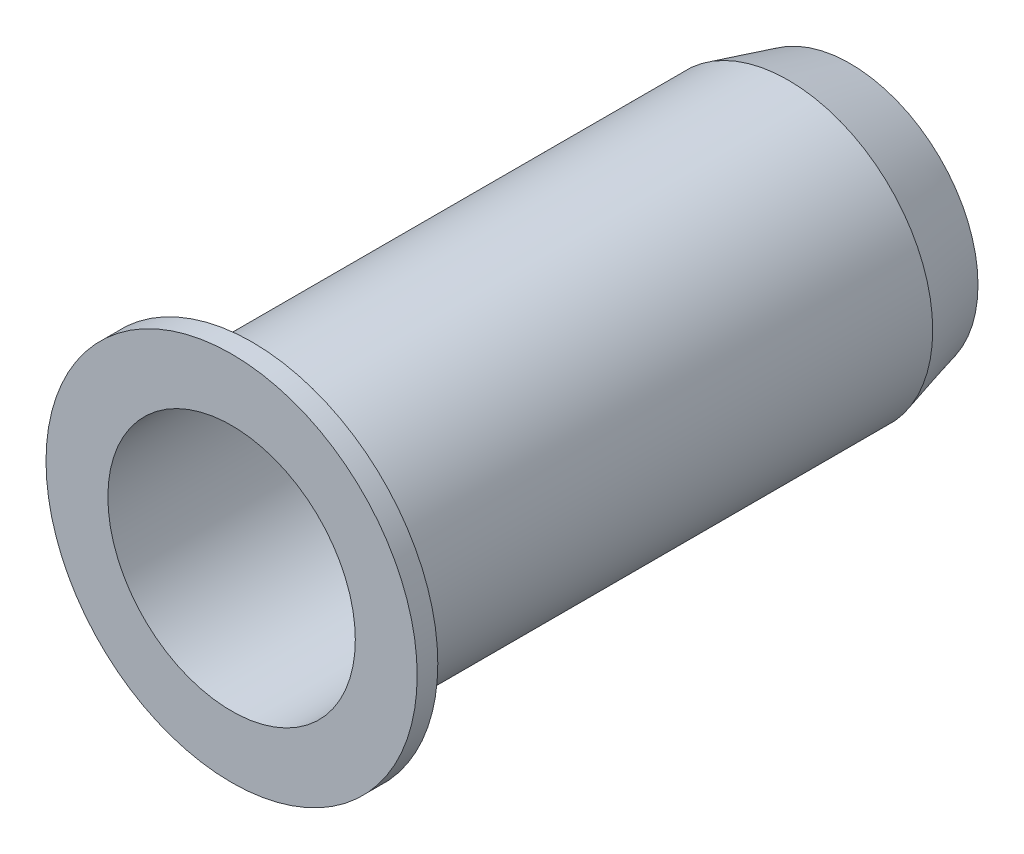
ISO-10303-21;
HEADER;
FILE_DESCRIPTION(('STEP AP214'),'2;1');
FILE_NAME('part.step','',(''),(''),'','','');
FILE_SCHEMA(('AUTOMOTIVE_DESIGN { 1 0 10303 214 1 1 1 1 }'));
ENDSEC;
DATA;
#1=APPLICATION_CONTEXT('core data for automotive mechanical design processes');
#2=APPLICATION_PROTOCOL_DEFINITION('international standard','automotive_design',2000,#1);
#3=PRODUCT_CONTEXT('',#1,'mechanical');
#4=PRODUCT('Part','Part','',(#3));
#5=PRODUCT_RELATED_PRODUCT_CATEGORY('part','',(#4));
#6=PRODUCT_DEFINITION_FORMATION('','',#4);
#7=PRODUCT_DEFINITION_CONTEXT('part definition',#1,'design');
#8=PRODUCT_DEFINITION('design','',#6,#7);
#9=PRODUCT_DEFINITION_SHAPE('','',#8);
#10=(LENGTH_UNIT() NAMED_UNIT(*) SI_UNIT(.MILLI.,.METRE.));
#11=(NAMED_UNIT(*) PLANE_ANGLE_UNIT() SI_UNIT($,.RADIAN.));
#12=(NAMED_UNIT(*) SI_UNIT($,.STERADIAN.) SOLID_ANGLE_UNIT());
#13=UNCERTAINTY_MEASURE_WITH_UNIT(LENGTH_MEASURE(1.E-05),#10,'distance_accuracy_value','');
#14=(GEOMETRIC_REPRESENTATION_CONTEXT(3) GLOBAL_UNCERTAINTY_ASSIGNED_CONTEXT((#13)) GLOBAL_UNIT_ASSIGNED_CONTEXT((#10,
#11,#12)) REPRESENTATION_CONTEXT('',''));
#15=CARTESIAN_POINT('',(0.,0.,0.));
#16=DIRECTION('',(0.,0.,1.));
#17=DIRECTION('',(1.,0.,0.));
#18=AXIS2_PLACEMENT_3D('',#15,#16,#17);
#19=CARTESIAN_POINT('',(0.,0.,0.));
#20=DIRECTION('',(0.,0.,1.));
#21=DIRECTION('',(1.,0.,0.));
#22=AXIS2_PLACEMENT_3D('',#19,#20,#21);
#23=PLANE('',#22);
#24=CARTESIAN_POINT('',(0.,0.,0.));
#25=DIRECTION('',(0.,0.,1.));
#26=DIRECTION('',(1.,0.,0.));
#27=AXIS2_PLACEMENT_3D('',#24,#25,#26);
#28=CIRCLE('',#27,3.0980762113533);
#29=CARTESIAN_POINT('',(3.0980762113533,0.,0.));
#30=VERTEX_POINT('',#29);
#31=EDGE_CURVE('E10',#30,#30,#28,.F.);
#32=ORIENTED_EDGE('',*,*,#31,.T.);
#33=EDGE_LOOP('',(#32));
#34=FACE_BOUND('',#33,.T.);
#35=CARTESIAN_POINT('',(0.,0.,0.));
#36=DIRECTION('',(0.,0.,1.));
#37=DIRECTION('',(1.,0.,0.));
#38=AXIS2_PLACEMENT_3D('',#35,#36,#37);
#39=CIRCLE('',#38,3.);
#40=CARTESIAN_POINT('',(-3.,0.,0.));
#41=VERTEX_POINT('',#40);
#42=EDGE_CURVE('E46',#41,#41,#39,.T.);
#43=ORIENTED_EDGE('',*,*,#42,.T.);
#44=EDGE_LOOP('',(#43));
#45=FACE_BOUND('',#44,.T.);
#46=ADVANCED_FACE('F31',(#34,#45),#23,.F.);
#47=CARTESIAN_POINT('',(0.,0.,14.5));
#48=DIRECTION('',(0.,0.,-1.));
#49=DIRECTION('',(-1.,0.,0.));
#50=AXIS2_PLACEMENT_3D('',#47,#48,#49);
#51=CYLINDRICAL_SURFACE('',#50,3.5);
#52=CARTESIAN_POINT('',(0.,0.,1.5));
#53=DIRECTION('',(0.,0.,1.));
#54=DIRECTION('',(1.,0.,0.));
#55=AXIS2_PLACEMENT_3D('',#52,#53,#54);
#56=CIRCLE('',#55,3.5);
#57=CARTESIAN_POINT('',(-3.5,0.,1.5));
#58=VERTEX_POINT('',#57);
#59=EDGE_CURVE('E38',#58,#58,#56,.T.);
#60=CARTESIAN_POINT('',(0.,0.,14.5));
#61=DIRECTION('',(0.,0.,1.));
#62=DIRECTION('',(1.,0.,0.));
#63=AXIS2_PLACEMENT_3D('',#60,#61,#62);
#64=CIRCLE('',#63,3.5);
#65=CARTESIAN_POINT('',(-3.5,0.,14.5));
#66=VERTEX_POINT('',#65);
#67=EDGE_CURVE('E42',#66,#66,#64,.T.);
#68=CARTESIAN_POINT('',(-3.5,0.,1.5));
#69=CARTESIAN_POINT('',(-3.5,0.,1.63541666666667));
#70=CARTESIAN_POINT('',(-3.5,0.,1.77083333333334));
#71=CARTESIAN_POINT('',(-3.5,0.,2.04166666666667));
#72=CARTESIAN_POINT('',(-3.5,0.,2.17708333333334));
#73=CARTESIAN_POINT('',(-3.5,0.,2.44791666666667));
#74=CARTESIAN_POINT('',(-3.5,0.,2.58333333333333));
#75=CARTESIAN_POINT('',(-3.5,0.,2.85416666666667));
#76=CARTESIAN_POINT('',(-3.5,0.,2.98958333333333));
#77=CARTESIAN_POINT('',(-3.5,0.,3.26041666666667));
#78=CARTESIAN_POINT('',(-3.5,0.,3.39583333333333));
#79=CARTESIAN_POINT('',(-3.5,0.,3.66666666666667));
#80=CARTESIAN_POINT('',(-3.5,0.,3.80208333333333));
#81=CARTESIAN_POINT('',(-3.5,0.,4.07291666666667));
#82=CARTESIAN_POINT('',(-3.5,0.,4.20833333333333));
#83=CARTESIAN_POINT('',(-3.5,0.,4.47916666666667));
#84=CARTESIAN_POINT('',(-3.5,0.,4.61458333333333));
#85=CARTESIAN_POINT('',(-3.5,0.,4.88541666666667));
#86=CARTESIAN_POINT('',(-3.5,0.,5.02083333333333));
#87=CARTESIAN_POINT('',(-3.5,0.,5.29166666666667));
#88=CARTESIAN_POINT('',(-3.5,0.,5.42708333333333));
#89=CARTESIAN_POINT('',(-3.5,0.,5.69791666666667));
#90=CARTESIAN_POINT('',(-3.5,0.,5.83333333333334));
#91=CARTESIAN_POINT('',(-3.5,0.,6.10416666666667));
#92=CARTESIAN_POINT('',(-3.5,0.,6.23958333333334));
#93=CARTESIAN_POINT('',(-3.5,0.,6.51041666666667));
#94=CARTESIAN_POINT('',(-3.5,0.,6.64583333333333));
#95=CARTESIAN_POINT('',(-3.5,0.,6.91666666666667));
#96=CARTESIAN_POINT('',(-3.5,0.,7.05208333333333));
#97=CARTESIAN_POINT('',(-3.5,0.,7.32291666666667));
#98=CARTESIAN_POINT('',(-3.5,0.,7.45833333333333));
#99=CARTESIAN_POINT('',(-3.5,0.,7.72916666666667));
#100=CARTESIAN_POINT('',(-3.5,0.,7.86458333333333));
#101=CARTESIAN_POINT('',(-3.5,0.,8.13541666666667));
#102=CARTESIAN_POINT('',(-3.5,0.,8.27083333333333));
#103=CARTESIAN_POINT('',(-3.5,0.,8.54166666666667));
#104=CARTESIAN_POINT('',(-3.5,0.,8.67708333333333));
#105=CARTESIAN_POINT('',(-3.5,0.,8.94791666666667));
#106=CARTESIAN_POINT('',(-3.5,0.,9.08333333333333));
#107=CARTESIAN_POINT('',(-3.5,0.,9.35416666666667));
#108=CARTESIAN_POINT('',(-3.5,0.,9.48958333333333));
#109=CARTESIAN_POINT('',(-3.5,0.,9.76041666666667));
#110=CARTESIAN_POINT('',(-3.5,0.,9.89583333333333));
#111=CARTESIAN_POINT('',(-3.5,0.,10.1666666666667));
#112=CARTESIAN_POINT('',(-3.5,0.,10.3020833333333));
#113=CARTESIAN_POINT('',(-3.5,0.,10.5729166666667));
#114=CARTESIAN_POINT('',(-3.5,0.,10.7083333333333));
#115=CARTESIAN_POINT('',(-3.5,0.,10.9791666666667));
#116=CARTESIAN_POINT('',(-3.5,0.,11.1145833333333));
#117=CARTESIAN_POINT('',(-3.5,0.,11.3854166666667));
#118=CARTESIAN_POINT('',(-3.5,0.,11.5208333333333));
#119=CARTESIAN_POINT('',(-3.5,0.,11.7916666666667));
#120=CARTESIAN_POINT('',(-3.5,0.,11.9270833333333));
#121=CARTESIAN_POINT('',(-3.5,0.,12.1979166666667));
#122=CARTESIAN_POINT('',(-3.5,0.,12.3333333333333));
#123=CARTESIAN_POINT('',(-3.5,0.,12.6041666666667));
#124=CARTESIAN_POINT('',(-3.5,0.,12.7395833333333));
#125=CARTESIAN_POINT('',(-3.5,0.,13.0104166666667));
#126=CARTESIAN_POINT('',(-3.5,0.,13.1458333333333));
#127=CARTESIAN_POINT('',(-3.5,0.,13.4166666666667));
#128=CARTESIAN_POINT('',(-3.5,0.,13.5520833333333));
#129=CARTESIAN_POINT('',(-3.5,0.,13.8229166666667));
#130=CARTESIAN_POINT('',(-3.5,0.,13.9583333333333));
#131=CARTESIAN_POINT('',(-3.5,0.,14.2291666666667));
#132=CARTESIAN_POINT('',(-3.5,0.,14.3645833333333));
#133=CARTESIAN_POINT('',(-3.5,0.,14.5));
#134=B_SPLINE_CURVE_WITH_KNOTS('',3,(#68,#69,#70,#71,#72,#73,#74,#75,#76,#77,#78,#79,#80,#81,
#82,#83,#84,#85,#86,#87,#88,#89,#90,#91,#92,#93,#94,#95,#96,#97,#98,#99,#100,#101,#102,#103,
#104,#105,#106,#107,#108,#109,#110,#111,#112,#113,#114,#115,#116,#117,#118,#119,#120,#121,#122,
#123,#124,#125,#126,#127,#128,#129,#130,#131,#132,#133),.UNSPECIFIED.,.F.,.F.,(4,2,2,2,2,2,2,2,
2,2,2,2,2,2,2,2,2,2,2,2,2,2,2,2,2,2,2,2,2,2,2,2,4),(0.,0.40625,0.812500000000001,1.21875,1.625,
2.03125,2.4375,2.84375,3.25,3.65625,4.0625,4.46875,4.875,5.28125,5.6875,6.09375,6.5,6.90625,
7.3125,7.71875,8.125,8.53125,8.9375,9.34375,9.75,10.15625,10.5625,10.96875,11.375,11.78125,
12.1875,12.59375,13.),.UNSPECIFIED.);
#135=EDGE_CURVE('BSEAM33',#58,#66,#134,.T.);
#136=ORIENTED_EDGE('',*,*,#59,.T.);
#137=ORIENTED_EDGE('',*,*,#67,.F.);
#138=ORIENTED_EDGE('',*,*,#135,.T.);
#139=ORIENTED_EDGE('',*,*,#135,.F.);
#140=EDGE_LOOP('',(#136,#138,#137,#139));
#141=FACE_BOUND('',#140,.T.);
#142=ADVANCED_FACE('F33',(#141),#51,.T.);
#143=CARTESIAN_POINT('',(0.,0.,14.5));
#144=DIRECTION('',(0.,0.,-1.));
#145=DIRECTION('',(-1.,0.,0.));
#146=AXIS2_PLACEMENT_3D('',#143,#144,#145);
#147=CYLINDRICAL_SURFACE('',#146,3.);
#148=CARTESIAN_POINT('',(0.,0.,15.));
#149=DIRECTION('',(0.,0.,1.));
#150=DIRECTION('',(1.,0.,0.));
#151=AXIS2_PLACEMENT_3D('',#148,#149,#150);
#152=CIRCLE('',#151,3.);
#153=CARTESIAN_POINT('',(-3.,0.,15.));
#154=VERTEX_POINT('',#153);
#155=EDGE_CURVE('E57',#154,#154,#152,.T.);
#156=CARTESIAN_POINT('',(-3.,0.,0.));
#157=CARTESIAN_POINT('',(-3.,0.,0.15625));
#158=CARTESIAN_POINT('',(-3.,0.,0.3125));
#159=CARTESIAN_POINT('',(-3.,0.,0.625000000000001));
#160=CARTESIAN_POINT('',(-3.,0.,0.781250000000001));
#161=CARTESIAN_POINT('',(-3.,0.,1.09375));
#162=CARTESIAN_POINT('',(-3.,0.,1.25));
#163=CARTESIAN_POINT('',(-3.,0.,1.5625));
#164=CARTESIAN_POINT('',(-3.,0.,1.71875));
#165=CARTESIAN_POINT('',(-3.,0.,2.03125));
#166=CARTESIAN_POINT('',(-3.,0.,2.1875));
#167=CARTESIAN_POINT('',(-3.,0.,2.5));
#168=CARTESIAN_POINT('',(-3.,0.,2.65625));
#169=CARTESIAN_POINT('',(-3.,0.,2.96875));
#170=CARTESIAN_POINT('',(-3.,0.,3.125));
#171=CARTESIAN_POINT('',(-3.,0.,3.4375));
#172=CARTESIAN_POINT('',(-3.,0.,3.59375));
#173=CARTESIAN_POINT('',(-3.,0.,3.90625));
#174=CARTESIAN_POINT('',(-3.,0.,4.0625));
#175=CARTESIAN_POINT('',(-3.,0.,4.375));
#176=CARTESIAN_POINT('',(-3.,0.,4.53125));
#177=CARTESIAN_POINT('',(-3.,0.,4.84375));
#178=CARTESIAN_POINT('',(-3.,0.,5.));
#179=CARTESIAN_POINT('',(-3.,0.,5.3125));
#180=CARTESIAN_POINT('',(-3.,0.,5.46875));
#181=CARTESIAN_POINT('',(-3.,0.,5.78125));
#182=CARTESIAN_POINT('',(-3.,0.,5.9375));
#183=CARTESIAN_POINT('',(-3.,0.,6.25));
#184=CARTESIAN_POINT('',(-3.,0.,6.40625));
#185=CARTESIAN_POINT('',(-3.,0.,6.71875));
#186=CARTESIAN_POINT('',(-3.,0.,6.875));
#187=CARTESIAN_POINT('',(-3.,0.,7.1875));
#188=CARTESIAN_POINT('',(-3.,0.,7.34375));
#189=CARTESIAN_POINT('',(-3.,0.,7.65625));
#190=CARTESIAN_POINT('',(-3.,0.,7.8125));
#191=CARTESIAN_POINT('',(-3.,0.,8.125));
#192=CARTESIAN_POINT('',(-3.,0.,8.28125));
#193=CARTESIAN_POINT('',(-3.,0.,8.59375));
#194=CARTESIAN_POINT('',(-3.,0.,8.75));
#195=CARTESIAN_POINT('',(-3.,0.,9.0625));
#196=CARTESIAN_POINT('',(-3.,0.,9.21875));
#197=CARTESIAN_POINT('',(-3.,0.,9.53125));
#198=CARTESIAN_POINT('',(-3.,0.,9.6875));
#199=CARTESIAN_POINT('',(-3.,0.,10.));
#200=CARTESIAN_POINT('',(-3.,0.,10.15625));
#201=CARTESIAN_POINT('',(-3.,0.,10.46875));
#202=CARTESIAN_POINT('',(-3.,0.,10.625));
#203=CARTESIAN_POINT('',(-3.,0.,10.9375));
#204=CARTESIAN_POINT('',(-3.,0.,11.09375));
#205=CARTESIAN_POINT('',(-3.,0.,11.40625));
#206=CARTESIAN_POINT('',(-3.,0.,11.5625));
#207=CARTESIAN_POINT('',(-3.,0.,11.875));
#208=CARTESIAN_POINT('',(-3.,0.,12.03125));
#209=CARTESIAN_POINT('',(-3.,0.,12.34375));
#210=CARTESIAN_POINT('',(-3.,0.,12.5));
#211=CARTESIAN_POINT('',(-3.,0.,12.8125));
#212=CARTESIAN_POINT('',(-3.,0.,12.96875));
#213=CARTESIAN_POINT('',(-3.,0.,13.28125));
#214=CARTESIAN_POINT('',(-3.,0.,13.4375));
#215=CARTESIAN_POINT('',(-3.,0.,13.75));
#216=CARTESIAN_POINT('',(-3.,0.,13.90625));
#217=CARTESIAN_POINT('',(-3.,0.,14.21875));
#218=CARTESIAN_POINT('',(-3.,0.,14.375));
#219=CARTESIAN_POINT('',(-3.,0.,14.6875));
#220=CARTESIAN_POINT('',(-3.,0.,14.84375));
#221=CARTESIAN_POINT('',(-3.,0.,15.));
#222=B_SPLINE_CURVE_WITH_KNOTS('',3,(#156,#157,#158,#159,#160,#161,#162,#163,#164,#165,#166,
#167,#168,#169,#170,#171,#172,#173,#174,#175,#176,#177,#178,#179,#180,#181,#182,#183,#184,#185,
#186,#187,#188,#189,#190,#191,#192,#193,#194,#195,#196,#197,#198,#199,#200,#201,#202,#203,#204,
#205,#206,#207,#208,#209,#210,#211,#212,#213,#214,#215,#216,#217,#218,#219,#220,#221),
.UNSPECIFIED.,.F.,.F.,(4,2,2,2,2,2,2,2,2,2,2,2,2,2,2,2,2,2,2,2,2,2,2,2,2,2,2,2,2,2,2,2,4),(0.,
0.46875,0.937500000000001,1.40625,1.875,2.34375,2.8125,3.28125,3.75,4.21875,4.6875,5.15625,
5.625,6.09375,6.5625,7.03125,7.5,7.96875,8.4375,8.90625,9.375,9.84375,10.3125,10.78125,11.25,
11.71875,12.1875,12.65625,13.125,13.59375,14.0625,14.53125,15.),.UNSPECIFIED.);
#223=EDGE_CURVE('BSEAM61',#41,#154,#222,.T.);
#224=ORIENTED_EDGE('',*,*,#42,.F.);
#225=ORIENTED_EDGE('',*,*,#155,.T.);
#226=ORIENTED_EDGE('',*,*,#223,.T.);
#227=ORIENTED_EDGE('',*,*,#223,.F.);
#228=EDGE_LOOP('',(#224,#226,#225,#227));
#229=FACE_BOUND('',#228,.T.);
#230=ADVANCED_FACE('F61',(#229),#147,.F.);
#231=CARTESIAN_POINT('',(0.,0.,14.5));
#232=DIRECTION('',(0.,0.,1.));
#233=DIRECTION('',(1.,0.,0.));
#234=AXIS2_PLACEMENT_3D('',#231,#232,#233);
#235=PLANE('',#234);
#236=CARTESIAN_POINT('',(0.,0.,14.5));
#237=DIRECTION('',(0.,0.,1.));
#238=DIRECTION('',(1.,0.,0.));
#239=AXIS2_PLACEMENT_3D('',#236,#237,#238);
#240=CIRCLE('',#239,4.5);
#241=CARTESIAN_POINT('',(4.5,0.,14.5));
#242=VERTEX_POINT('',#241);
#243=EDGE_CURVE('E54',#242,#242,#240,.T.);
#244=ORIENTED_EDGE('',*,*,#243,.F.);
#245=EDGE_LOOP('',(#244));
#246=FACE_BOUND('',#245,.T.);
#247=ORIENTED_EDGE('',*,*,#67,.T.);
#248=EDGE_LOOP('',(#247));
#249=FACE_BOUND('',#248,.T.);
#250=ADVANCED_FACE('F66',(#246,#249),#235,.F.);
#251=CARTESIAN_POINT('',(0.,0.,15.));
#252=DIRECTION('',(0.,0.,1.));
#253=DIRECTION('',(1.,0.,0.));
#254=AXIS2_PLACEMENT_3D('',#251,#252,#253);
#255=PLANE('',#254);
#256=CARTESIAN_POINT('',(0.,0.,15.));
#257=DIRECTION('',(0.,0.,1.));
#258=DIRECTION('',(1.,0.,0.));
#259=AXIS2_PLACEMENT_3D('',#256,#257,#258);
#260=CIRCLE('',#259,4.5);
#261=CARTESIAN_POINT('',(4.5,0.,15.));
#262=VERTEX_POINT('',#261);
#263=EDGE_CURVE('E51',#262,#262,#260,.T.);
#264=ORIENTED_EDGE('',*,*,#263,.T.);
#265=EDGE_LOOP('',(#264));
#266=FACE_BOUND('',#265,.T.);
#267=ORIENTED_EDGE('',*,*,#155,.F.);
#268=EDGE_LOOP('',(#267));
#269=FACE_BOUND('',#268,.T.);
#270=ADVANCED_FACE('F63',(#266,#269),#255,.T.);
#271=CARTESIAN_POINT('',(0.,0.,15.));
#272=DIRECTION('',(0.,0.,-1.));
#273=DIRECTION('',(-1.,0.,0.));
#274=AXIS2_PLACEMENT_3D('',#271,#272,#273);
#275=CYLINDRICAL_SURFACE('',#274,4.5);
#276=ORIENTED_EDGE('',*,*,#263,.F.);
#277=EDGE_LOOP('',(#276));
#278=FACE_BOUND('',#277,.T.);
#279=ORIENTED_EDGE('',*,*,#243,.T.);
#280=EDGE_LOOP('',(#279));
#281=FACE_BOUND('',#280,.T.);
#282=ADVANCED_FACE('F65',(#278,#281),#275,.T.);
#283=CARTESIAN_POINT('',(0.,0.,1.5));
#284=DIRECTION('',(0.,0.,1.));
#285=DIRECTION('',(1.,0.,0.));
#286=AXIS2_PLACEMENT_3D('',#283,#284,#285);
#287=CONICAL_SURFACE('',#286,3.5,0.261799387799157);
#288=ORIENTED_EDGE('',*,*,#31,.F.);
#289=EDGE_LOOP('',(#288));
#290=FACE_BOUND('',#289,.T.);
#291=ORIENTED_EDGE('',*,*,#59,.F.);
#292=EDGE_LOOP('',(#291));
#293=FACE_BOUND('',#292,.T.);
#294=ADVANCED_FACE('F73',(#290,#293),#287,.T.);
#295=CLOSED_SHELL('',(#46,#142,#230,#250,#270,#282,#294));
#296=MANIFOLD_SOLID_BREP('B2',#295);
#297=ADVANCED_BREP_SHAPE_REPRESENTATION('',(#18,#296),#14);
#298=SHAPE_DEFINITION_REPRESENTATION(#9,#297);
ENDSEC;
END-ISO-10303-21;
